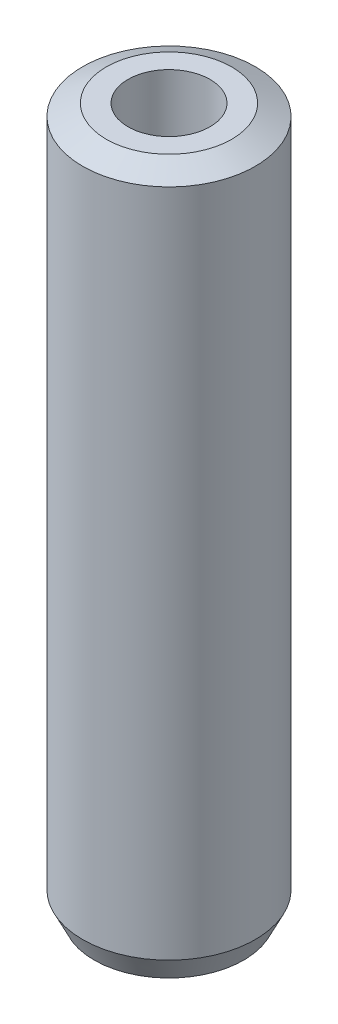
ISO-10303-21;
HEADER;
FILE_DESCRIPTION(('STEP AP214'),'2;1');
FILE_NAME('part.step','',(''),(''),'','','');
FILE_SCHEMA(('AUTOMOTIVE_DESIGN { 1 0 10303 214 1 1 1 1 }'));
ENDSEC;
DATA;
#1=APPLICATION_CONTEXT('core data for automotive mechanical design processes');
#2=APPLICATION_PROTOCOL_DEFINITION('international standard','automotive_design',2000,#1);
#3=PRODUCT_CONTEXT('',#1,'mechanical');
#4=PRODUCT('Part','Part','',(#3));
#5=PRODUCT_RELATED_PRODUCT_CATEGORY('part','',(#4));
#6=PRODUCT_DEFINITION_FORMATION('','',#4);
#7=PRODUCT_DEFINITION_CONTEXT('part definition',#1,'design');
#8=PRODUCT_DEFINITION('design','',#6,#7);
#9=PRODUCT_DEFINITION_SHAPE('','',#8);
#10=(LENGTH_UNIT() NAMED_UNIT(*) SI_UNIT(.MILLI.,.METRE.));
#11=(NAMED_UNIT(*) PLANE_ANGLE_UNIT() SI_UNIT($,.RADIAN.));
#12=(NAMED_UNIT(*) SI_UNIT($,.STERADIAN.) SOLID_ANGLE_UNIT());
#13=UNCERTAINTY_MEASURE_WITH_UNIT(LENGTH_MEASURE(1.E-05),#10,'distance_accuracy_value','');
#14=(GEOMETRIC_REPRESENTATION_CONTEXT(3) GLOBAL_UNCERTAINTY_ASSIGNED_CONTEXT((#13)) GLOBAL_UNIT_ASSIGNED_CONTEXT((#10,
#11,#12)) REPRESENTATION_CONTEXT('',''));
#15=CARTESIAN_POINT('',(0.,0.,0.));
#16=DIRECTION('',(0.,0.,1.));
#17=DIRECTION('',(1.,0.,0.));
#18=AXIS2_PLACEMENT_3D('',#15,#16,#17);
#19=CARTESIAN_POINT('',(0.,61.234998258829,0.));
#20=DIRECTION('',(0.,-1.,0.));
#21=DIRECTION('',(0.,0.,-1.));
#22=AXIS2_PLACEMENT_3D('',#19,#20,#21);
#23=CYLINDRICAL_SURFACE('',#22,7.5);
#24=CARTESIAN_POINT('',(0.,60.2290035038846,0.));
#25=DIRECTION('',(0.,1.,0.));
#26=DIRECTION('',(0.,0.,1.));
#27=AXIS2_PLACEMENT_3D('',#24,#25,#26);
#28=CIRCLE('',#27,7.5);
#29=CARTESIAN_POINT('',(0.,60.2290035038846,-7.5));
#30=VERTEX_POINT('',#29);
#31=EDGE_CURVE('E50',#30,#30,#28,.F.);
#32=CARTESIAN_POINT('',(0.,2.05302255390008,0.));
#33=DIRECTION('',(0.,1.,0.));
#34=DIRECTION('',(0.,0.,1.));
#35=AXIS2_PLACEMENT_3D('',#32,#33,#34);
#36=CIRCLE('',#35,7.5);
#37=CARTESIAN_POINT('',(0.,2.05302255390008,-7.5));
#38=VERTEX_POINT('',#37);
#39=EDGE_CURVE('E51',#38,#38,#36,.T.);
#40=CARTESIAN_POINT('',(0.,60.2290035038846,-7.5));
#41=CARTESIAN_POINT('',(0.,59.6230037023223,-7.5));
#42=CARTESIAN_POINT('',(0.,59.01700390076,-7.5));
#43=CARTESIAN_POINT('',(0.,57.8050042976353,-7.5));
#44=CARTESIAN_POINT('',(0.,57.1990044960729,-7.5));
#45=CARTESIAN_POINT('',(0.,55.9870048929483,-7.5));
#46=CARTESIAN_POINT('',(0.,55.3810050913859,-7.5));
#47=CARTESIAN_POINT('',(0.,54.1690054882612,-7.5));
#48=CARTESIAN_POINT('',(0.,53.5630056866989,-7.5));
#49=CARTESIAN_POINT('',(0.,52.3510060835742,-7.5));
#50=CARTESIAN_POINT('',(0.,51.7450062820119,-7.5));
#51=CARTESIAN_POINT('',(0.,50.5330066788872,-7.5));
#52=CARTESIAN_POINT('',(0.,49.9270068773249,-7.5));
#53=CARTESIAN_POINT('',(0.,48.7150072742002,-7.5));
#54=CARTESIAN_POINT('',(0.,48.1090074726379,-7.5));
#55=CARTESIAN_POINT('',(0.,46.8970078695132,-7.5));
#56=CARTESIAN_POINT('',(0.,46.2910080679508,-7.5));
#57=CARTESIAN_POINT('',(0.,45.0790084648262,-7.5));
#58=CARTESIAN_POINT('',(0.,44.4730086632638,-7.5));
#59=CARTESIAN_POINT('',(0.,43.2610090601391,-7.5));
#60=CARTESIAN_POINT('',(0.,42.6550092585768,-7.5));
#61=CARTESIAN_POINT('',(0.,41.4430096554521,-7.5));
#62=CARTESIAN_POINT('',(0.,40.8370098538898,-7.5));
#63=CARTESIAN_POINT('',(0.,39.6250102507651,-7.5));
#64=CARTESIAN_POINT('',(0.,39.0190104492028,-7.5));
#65=CARTESIAN_POINT('',(0.,37.8070108460781,-7.5));
#66=CARTESIAN_POINT('',(0.,37.2010110445157,-7.5));
#67=CARTESIAN_POINT('',(0.,35.9890114413911,-7.5));
#68=CARTESIAN_POINT('',(0.,35.3830116398287,-7.5));
#69=CARTESIAN_POINT('',(0.,34.171012036704,-7.5));
#70=CARTESIAN_POINT('',(0.,33.5650122351417,-7.5));
#71=CARTESIAN_POINT('',(0.,32.353012632017,-7.5));
#72=CARTESIAN_POINT('',(0.,31.7470128304547,-7.5));
#73=CARTESIAN_POINT('',(0.,30.53501322733,-7.5));
#74=CARTESIAN_POINT('',(0.,29.9290134257677,-7.5));
#75=CARTESIAN_POINT('',(0.,28.717013822643,-7.5));
#76=CARTESIAN_POINT('',(0.,28.1110140210807,-7.5));
#77=CARTESIAN_POINT('',(0.,26.899014417956,-7.5));
#78=CARTESIAN_POINT('',(0.,26.2930146163936,-7.5));
#79=CARTESIAN_POINT('',(0.,25.081015013269,-7.5));
#80=CARTESIAN_POINT('',(0.,24.4750152117066,-7.5));
#81=CARTESIAN_POINT('',(0.,23.2630156085819,-7.5));
#82=CARTESIAN_POINT('',(0.,22.6570158070196,-7.5));
#83=CARTESIAN_POINT('',(0.,21.4450162038949,-7.5));
#84=CARTESIAN_POINT('',(0.,20.8390164023326,-7.5));
#85=CARTESIAN_POINT('',(0.,19.6270167992079,-7.5));
#86=CARTESIAN_POINT('',(0.,19.0210169976456,-7.5));
#87=CARTESIAN_POINT('',(0.,17.8090173945209,-7.5));
#88=CARTESIAN_POINT('',(0.,17.2030175929586,-7.5));
#89=CARTESIAN_POINT('',(0.,15.9910179898339,-7.5));
#90=CARTESIAN_POINT('',(0.,15.3850181882715,-7.5));
#91=CARTESIAN_POINT('',(0.,14.1730185851469,-7.5));
#92=CARTESIAN_POINT('',(0.,13.5670187835845,-7.5));
#93=CARTESIAN_POINT('',(0.,12.3550191804598,-7.5));
#94=CARTESIAN_POINT('',(0.,11.7490193788975,-7.5));
#95=CARTESIAN_POINT('',(0.,10.5370197757728,-7.5));
#96=CARTESIAN_POINT('',(0.,9.93101997421049,-7.5));
#97=CARTESIAN_POINT('',(0.,8.71902037108581,-7.5));
#98=CARTESIAN_POINT('',(0.,8.11302056952347,-7.5));
#99=CARTESIAN_POINT('',(0.,6.90102096639879,-7.5));
#100=CARTESIAN_POINT('',(0.,6.29502116483645,-7.5));
#101=CARTESIAN_POINT('',(0.,5.08302156171177,-7.5));
#102=CARTESIAN_POINT('',(0.,4.47702176014944,-7.5));
#103=CARTESIAN_POINT('',(0.,3.26502215702476,-7.5));
#104=CARTESIAN_POINT('',(0.,2.65902235546242,-7.5));
#105=CARTESIAN_POINT('',(0.,2.05302255390008,-7.5));
#106=B_SPLINE_CURVE_WITH_KNOTS('',3,(#40,#41,#42,#43,#44,#45,#46,#47,#48,#49,#50,#51,#52,#53,
#54,#55,#56,#57,#58,#59,#60,#61,#62,#63,#64,#65,#66,#67,#68,#69,#70,#71,#72,#73,#74,#75,#76,#77,
#78,#79,#80,#81,#82,#83,#84,#85,#86,#87,#88,#89,#90,#91,#92,#93,#94,#95,#96,#97,#98,#99,#100,
#101,#102,#103,#104,#105),.UNSPECIFIED.,.F.,.F.,(4,2,2,2,2,2,2,2,2,2,2,2,2,2,2,2,2,2,2,2,2,2,2,
2,2,2,2,2,2,2,2,2,4),(0.,1.81799940468702,3.63599880937403,5.45399821406106,7.27199761874808,
9.08999702343509,10.9079964281221,12.7259958328091,14.5439952374961,16.3619946421832,
18.1799940468702,19.9979934515572,21.8159928562442,23.6339922609312,25.4519916656182,
27.2699910703053,29.0879904749923,30.9059898796793,32.7239892843663,34.5419886890533,
36.3599880937403,38.1779874984274,39.9959869031144,41.8139863078014,43.6319857124884,
45.4499851171754,47.2679845218625,49.0859839265495,50.9039833312365,52.7219827359235,
54.5399821406105,56.3579815452975,58.1759809499846),.UNSPECIFIED.);
#107=EDGE_CURVE('BSEAM39',#30,#38,#106,.T.);
#108=ORIENTED_EDGE('',*,*,#31,.T.);
#109=ORIENTED_EDGE('',*,*,#39,.T.);
#110=ORIENTED_EDGE('',*,*,#107,.T.);
#111=ORIENTED_EDGE('',*,*,#107,.F.);
#112=EDGE_LOOP('',(#108,#110,#109,#111));
#113=FACE_BOUND('',#112,.T.);
#114=ADVANCED_FACE('F39',(#113),#23,.T.);
#115=CARTESIAN_POINT('',(0.,61.234998258829,0.));
#116=DIRECTION('',(0.,1.,0.));
#117=DIRECTION('',(0.,0.,1.));
#118=AXIS2_PLACEMENT_3D('',#115,#116,#117);
#119=PLANE('',#118);
#120=CARTESIAN_POINT('',(0.,61.234998258829,0.));
#121=DIRECTION('',(0.,1.,0.));
#122=DIRECTION('',(0.,0.,1.));
#123=AXIS2_PLACEMENT_3D('',#120,#121,#122);
#124=CIRCLE('',#123,5.44697744610005);
#125=CARTESIAN_POINT('',(0.,61.234998258829,5.44697744610005));
#126=VERTEX_POINT('',#125);
#127=EDGE_CURVE('E54',#126,#126,#124,.T.);
#128=ORIENTED_EDGE('',*,*,#127,.T.);
#129=EDGE_LOOP('',(#128));
#130=FACE_BOUND('',#129,.T.);
#131=CARTESIAN_POINT('',(0.,61.234998258829,0.));
#132=DIRECTION('',(0.,1.,0.));
#133=DIRECTION('',(0.,0.,1.));
#134=AXIS2_PLACEMENT_3D('',#131,#132,#133);
#135=CIRCLE('',#134,3.56560680264181);
#136=CARTESIAN_POINT('',(0.,61.234998258829,-3.56560680264181));
#137=VERTEX_POINT('',#136);
#138=EDGE_CURVE('E58',#137,#137,#135,.T.);
#139=ORIENTED_EDGE('',*,*,#138,.F.);
#140=EDGE_LOOP('',(#139));
#141=FACE_BOUND('',#140,.T.);
#142=ADVANCED_FACE('F69',(#130,#141),#119,.T.);
#143=CARTESIAN_POINT('',(0.,0.,0.));
#144=DIRECTION('',(0.,1.,0.));
#145=DIRECTION('',(0.,0.,1.));
#146=AXIS2_PLACEMENT_3D('',#143,#144,#145);
#147=PLANE('',#146);
#148=CARTESIAN_POINT('',(0.,0.,0.));
#149=DIRECTION('',(0.,1.,0.));
#150=DIRECTION('',(0.,0.,1.));
#151=AXIS2_PLACEMENT_3D('',#148,#149,#150);
#152=CIRCLE('',#151,6.49400524505562);
#153=CARTESIAN_POINT('',(0.,0.,6.49400524505562));
#154=VERTEX_POINT('',#153);
#155=EDGE_CURVE('E10',#154,#154,#152,.F.);
#156=ORIENTED_EDGE('',*,*,#155,.T.);
#157=EDGE_LOOP('',(#156));
#158=FACE_BOUND('',#157,.T.);
#159=CARTESIAN_POINT('',(0.,0.,0.));
#160=DIRECTION('',(0.,1.,0.));
#161=DIRECTION('',(0.,0.,1.));
#162=AXIS2_PLACEMENT_3D('',#159,#160,#161);
#163=CIRCLE('',#162,3.56560680264181);
#164=CARTESIAN_POINT('',(0.,0.,-3.56560680264181));
#165=VERTEX_POINT('',#164);
#166=EDGE_CURVE('E63',#165,#165,#163,.T.);
#167=ORIENTED_EDGE('',*,*,#166,.T.);
#168=EDGE_LOOP('',(#167));
#169=FACE_BOUND('',#168,.T.);
#170=ADVANCED_FACE('F75',(#158,#169),#147,.F.);
#171=CARTESIAN_POINT('',(0.,61.234998258829,0.));
#172=DIRECTION('',(0.,-1.,0.));
#173=DIRECTION('',(0.,0.,-1.));
#174=AXIS2_PLACEMENT_3D('',#171,#172,#173);
#175=CYLINDRICAL_SURFACE('',#174,3.56560680264181);
#176=CARTESIAN_POINT('',(0.,61.234998258829,-3.56560680264181));
#177=CARTESIAN_POINT('',(0.,60.5971336936328,-3.56560680264181));
#178=CARTESIAN_POINT('',(0.,59.9592691284367,-3.56560680264181));
#179=CARTESIAN_POINT('',(0.,58.6835399980444,-3.56560680264181));
#180=CARTESIAN_POINT('',(0.,58.0456754328483,-3.56560680264181));
#181=CARTESIAN_POINT('',(0.,56.769946302456,-3.56560680264181));
#182=CARTESIAN_POINT('',(0.,56.1320817372599,-3.56560680264181));
#183=CARTESIAN_POINT('',(0.,54.8563526068676,-3.56560680264181));
#184=CARTESIAN_POINT('',(0.,54.2184880416715,-3.56560680264181));
#185=CARTESIAN_POINT('',(0.,52.9427589112792,-3.56560680264181));
#186=CARTESIAN_POINT('',(0.,52.3048943460831,-3.56560680264181));
#187=CARTESIAN_POINT('',(0.,51.0291652156908,-3.56560680264181));
#188=CARTESIAN_POINT('',(0.,50.3913006504946,-3.56560680264181));
#189=CARTESIAN_POINT('',(0.,49.1155715201024,-3.56560680264181));
#190=CARTESIAN_POINT('',(0.,48.4777069549062,-3.56560680264181));
#191=CARTESIAN_POINT('',(0.,47.201977824514,-3.56560680264181));
#192=CARTESIAN_POINT('',(0.,46.5641132593178,-3.56560680264181));
#193=CARTESIAN_POINT('',(0.,45.2883841289256,-3.56560680264181));
#194=CARTESIAN_POINT('',(0.,44.6505195637294,-3.56560680264181));
#195=CARTESIAN_POINT('',(0.,43.3747904333372,-3.56560680264181));
#196=CARTESIAN_POINT('',(0.,42.736925868141,-3.56560680264181));
#197=CARTESIAN_POINT('',(0.,41.4611967377488,-3.56560680264181));
#198=CARTESIAN_POINT('',(0.,40.8233321725526,-3.56560680264181));
#199=CARTESIAN_POINT('',(0.,39.5476030421604,-3.56560680264181));
#200=CARTESIAN_POINT('',(0.,38.9097384769642,-3.56560680264181));
#201=CARTESIAN_POINT('',(0.,37.634009346572,-3.56560680264181));
#202=CARTESIAN_POINT('',(0.,36.9961447813758,-3.56560680264181));
#203=CARTESIAN_POINT('',(0.,35.7204156509835,-3.56560680264181));
#204=CARTESIAN_POINT('',(0.,35.0825510857874,-3.56560680264181));
#205=CARTESIAN_POINT('',(0.,33.8068219553951,-3.56560680264181));
#206=CARTESIAN_POINT('',(0.,33.168957390199,-3.56560680264181));
#207=CARTESIAN_POINT('',(0.,31.8932282598067,-3.56560680264181));
#208=CARTESIAN_POINT('',(0.,31.2553636946106,-3.56560680264181));
#209=CARTESIAN_POINT('',(0.,29.9796345642183,-3.56560680264181));
#210=CARTESIAN_POINT('',(0.,29.3417699990222,-3.56560680264181));
#211=CARTESIAN_POINT('',(0.,28.0660408686299,-3.56560680264181));
#212=CARTESIAN_POINT('',(0.,27.4281763034338,-3.56560680264181));
#213=CARTESIAN_POINT('',(0.,26.1524471730415,-3.56560680264181));
#214=CARTESIAN_POINT('',(0.,25.5145826078454,-3.56560680264181));
#215=CARTESIAN_POINT('',(0.,24.2388534774531,-3.56560680264181));
#216=CARTESIAN_POINT('',(0.,23.600988912257,-3.56560680264181));
#217=CARTESIAN_POINT('',(0.,22.3252597818647,-3.56560680264181));
#218=CARTESIAN_POINT('',(0.,21.6873952166686,-3.56560680264181));
#219=CARTESIAN_POINT('',(0.,20.4116660862763,-3.56560680264181));
#220=CARTESIAN_POINT('',(0.,19.7738015210802,-3.56560680264181));
#221=CARTESIAN_POINT('',(0.,18.4980723906879,-3.56560680264181));
#222=CARTESIAN_POINT('',(0.,17.8602078254918,-3.56560680264181));
#223=CARTESIAN_POINT('',(0.,16.5844786950995,-3.56560680264181));
#224=CARTESIAN_POINT('',(0.,15.9466141299034,-3.56560680264181));
#225=CARTESIAN_POINT('',(0.,14.6708849995111,-3.56560680264181));
#226=CARTESIAN_POINT('',(0.,14.033020434315,-3.56560680264181));
#227=CARTESIAN_POINT('',(0.,12.7572913039227,-3.56560680264181));
#228=CARTESIAN_POINT('',(0.,12.1194267387266,-3.56560680264181));
#229=CARTESIAN_POINT('',(0.,10.8436976083343,-3.56560680264181));
#230=CARTESIAN_POINT('',(0.,10.2058330431382,-3.56560680264181));
#231=CARTESIAN_POINT('',(0.,8.93010391274589,-3.56560680264181));
#232=CARTESIAN_POINT('',(0.,8.29223934754975,-3.56560680264181));
#233=CARTESIAN_POINT('',(0.,7.01651021715748,-3.56560680264181));
#234=CARTESIAN_POINT('',(0.,6.37864565196135,-3.56560680264181));
#235=CARTESIAN_POINT('',(0.,5.10291652156908,-3.56560680264181));
#236=CARTESIAN_POINT('',(0.,4.46505195637294,-3.56560680264181));
#237=CARTESIAN_POINT('',(0.,3.18932282598067,-3.56560680264181));
#238=CARTESIAN_POINT('',(0.,2.55145826078454,-3.56560680264181));
#239=CARTESIAN_POINT('',(0.,1.27572913039227,-3.56560680264181));
#240=CARTESIAN_POINT('',(0.,0.637864565196135,-3.56560680264181));
#241=CARTESIAN_POINT('',(0.,0.,-3.56560680264181));
#242=B_SPLINE_CURVE_WITH_KNOTS('',3,(#176,#177,#178,#179,#180,#181,#182,#183,#184,#185,#186,
#187,#188,#189,#190,#191,#192,#193,#194,#195,#196,#197,#198,#199,#200,#201,#202,#203,#204,#205,
#206,#207,#208,#209,#210,#211,#212,#213,#214,#215,#216,#217,#218,#219,#220,#221,#222,#223,#224,
#225,#226,#227,#228,#229,#230,#231,#232,#233,#234,#235,#236,#237,#238,#239,#240,#241),
.UNSPECIFIED.,.F.,.F.,(4,2,2,2,2,2,2,2,2,2,2,2,2,2,2,2,2,2,2,2,2,2,2,2,2,2,2,2,2,2,2,2,4),(0.,
1.91359369558841,3.82718739117682,5.74078108676522,7.65437478235363,9.56796847794202,
11.4815621735304,13.3951558691188,15.3087495647072,17.2223432602956,19.1359369558841,
21.0495306514724,22.9631243470609,24.8767180426493,26.7903117382377,28.7039054338261,
30.6174991294145,32.5310928250029,34.4446865205913,36.3582802161797,38.2718739117681,
40.1854676073565,42.0990613029449,44.0126549985333,45.9262486941217,47.8398423897101,
49.7534360852985,51.6670297808869,53.5806234764753,55.4942171720637,57.4078108676521,
59.3214045632405,61.234998258829),.UNSPECIFIED.);
#243=EDGE_CURVE('BSEAM70',#137,#165,#242,.T.);
#244=ORIENTED_EDGE('',*,*,#138,.T.);
#245=ORIENTED_EDGE('',*,*,#166,.F.);
#246=ORIENTED_EDGE('',*,*,#243,.T.);
#247=ORIENTED_EDGE('',*,*,#243,.F.);
#248=EDGE_LOOP('',(#244,#246,#245,#247));
#249=FACE_BOUND('',#248,.T.);
#250=ADVANCED_FACE('F70',(#249),#175,.F.);
#251=CARTESIAN_POINT('',(0.,61.234998258829,0.));
#252=DIRECTION('',(0.,-1.,0.));
#253=DIRECTION('',(0.,0.,-1.));
#254=AXIS2_PLACEMENT_3D('',#251,#252,#253);
#255=CONICAL_SURFACE('',#254,5.44697744610005,1.11517529112149);
#256=ORIENTED_EDGE('',*,*,#31,.F.);
#257=EDGE_LOOP('',(#256));
#258=FACE_BOUND('',#257,.T.);
#259=ORIENTED_EDGE('',*,*,#127,.F.);
#260=EDGE_LOOP('',(#259));
#261=FACE_BOUND('',#260,.T.);
#262=ADVANCED_FACE('F81',(#258,#261),#255,.T.);
#263=CARTESIAN_POINT('',(0.,2.05302255390008,0.));
#264=DIRECTION('',(0.,1.,0.));
#265=DIRECTION('',(0.,0.,1.));
#266=AXIS2_PLACEMENT_3D('',#263,#264,#265);
#267=CONICAL_SURFACE('',#266,7.5,0.455621035673411);
#268=ORIENTED_EDGE('',*,*,#155,.F.);
#269=EDGE_LOOP('',(#268));
#270=FACE_BOUND('',#269,.T.);
#271=ORIENTED_EDGE('',*,*,#39,.F.);
#272=EDGE_LOOP('',(#271));
#273=FACE_BOUND('',#272,.T.);
#274=ADVANCED_FACE('F45',(#270,#273),#267,.T.);
#275=CLOSED_SHELL('',(#114,#142,#170,#250,#262,#274));
#276=MANIFOLD_SOLID_BREP('B2',#275);
#277=ADVANCED_BREP_SHAPE_REPRESENTATION('',(#18,#276),#14);
#278=SHAPE_DEFINITION_REPRESENTATION(#9,#277);
ENDSEC;
END-ISO-10303-21;
